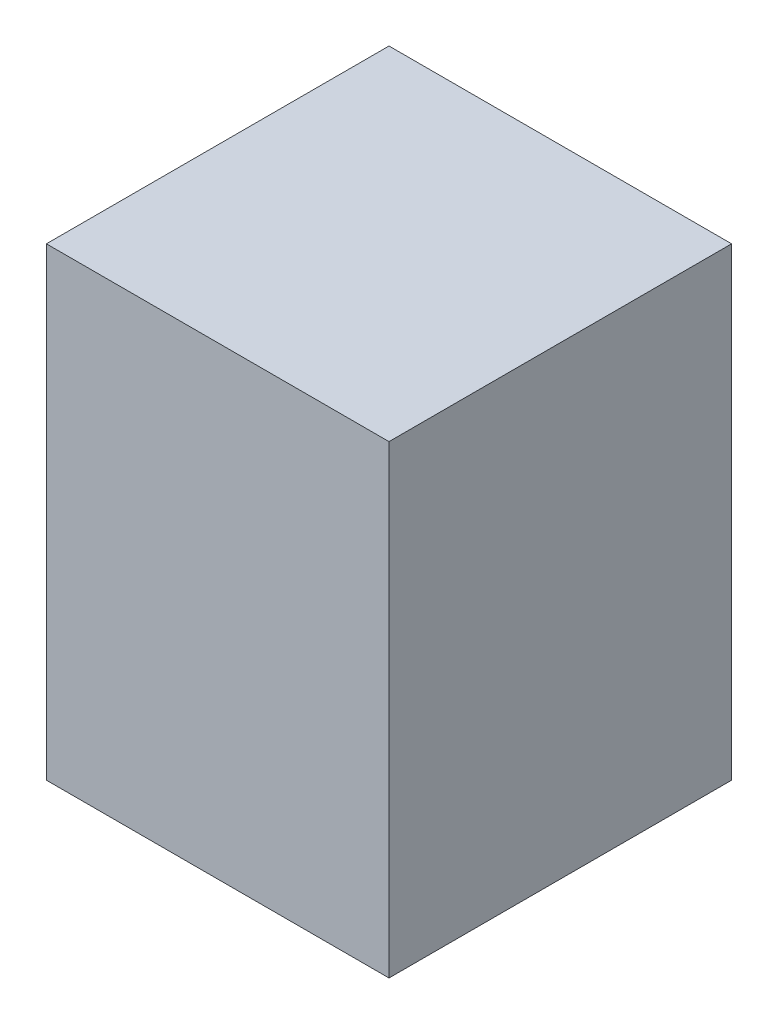
ISO-10303-21;
HEADER;
FILE_DESCRIPTION(('STEP AP214'),'2;1');
FILE_NAME('part.step','',(''),(''),'','','');
FILE_SCHEMA(('AUTOMOTIVE_DESIGN { 1 0 10303 214 1 1 1 1 }'));
ENDSEC;
DATA;
#1=APPLICATION_CONTEXT('core data for automotive mechanical design processes');
#2=APPLICATION_PROTOCOL_DEFINITION('international standard','automotive_design',2000,#1);
#3=PRODUCT_CONTEXT('',#1,'mechanical');
#4=PRODUCT('Part','Part','',(#3));
#5=PRODUCT_RELATED_PRODUCT_CATEGORY('part','',(#4));
#6=PRODUCT_DEFINITION_FORMATION('','',#4);
#7=PRODUCT_DEFINITION_CONTEXT('part definition',#1,'design');
#8=PRODUCT_DEFINITION('design','',#6,#7);
#9=PRODUCT_DEFINITION_SHAPE('','',#8);
#10=(LENGTH_UNIT() NAMED_UNIT(*) SI_UNIT(.MILLI.,.METRE.));
#11=(NAMED_UNIT(*) PLANE_ANGLE_UNIT() SI_UNIT($,.RADIAN.));
#12=(NAMED_UNIT(*) SI_UNIT($,.STERADIAN.) SOLID_ANGLE_UNIT());
#13=UNCERTAINTY_MEASURE_WITH_UNIT(LENGTH_MEASURE(1.E-05),#10,'distance_accuracy_value','');
#14=(GEOMETRIC_REPRESENTATION_CONTEXT(3) GLOBAL_UNCERTAINTY_ASSIGNED_CONTEXT((#13)) GLOBAL_UNIT_ASSIGNED_CONTEXT((#10,
#11,#12)) REPRESENTATION_CONTEXT('',''));
#15=CARTESIAN_POINT('',(0.,0.,0.));
#16=DIRECTION('',(0.,0.,1.));
#17=DIRECTION('',(1.,0.,0.));
#18=AXIS2_PLACEMENT_3D('',#15,#16,#17);
#19=CARTESIAN_POINT('',(-7.375,20.,7.375));
#20=DIRECTION('',(1.,0.,0.));
#21=DIRECTION('',(0.,0.,-1.));
#22=AXIS2_PLACEMENT_3D('',#19,#20,#21);
#23=PLANE('',#22);
#24=DIRECTION('',(0.,0.,1.));
#25=VECTOR('',#24,1.);
#26=CARTESIAN_POINT('',(-7.375,0.,7.375));
#27=LINE('',#26,#25);
#28=CARTESIAN_POINT('',(-7.375,0.,-7.375));
#29=VERTEX_POINT('',#28);
#30=CARTESIAN_POINT('',(-7.375,0.,7.375));
#31=VERTEX_POINT('',#30);
#32=EDGE_CURVE('E96',#29,#31,#27,.T.);
#33=ORIENTED_EDGE('',*,*,#32,.T.);
#34=DIRECTION('',(0.,-1.,0.));
#35=VECTOR('',#34,1.);
#36=CARTESIAN_POINT('',(-7.375,20.,7.375));
#37=LINE('',#36,#35);
#38=CARTESIAN_POINT('',(-7.375,20.,7.375));
#39=VERTEX_POINT('',#38);
#40=EDGE_CURVE('E11',#39,#31,#37,.T.);
#41=ORIENTED_EDGE('',*,*,#40,.F.);
#42=DIRECTION('',(0.,0.,1.));
#43=VECTOR('',#42,1.);
#44=CARTESIAN_POINT('',(-7.375,20.,7.375));
#45=LINE('',#44,#43);
#46=CARTESIAN_POINT('',(-7.375,20.,-7.375));
#47=VERTEX_POINT('',#46);
#48=EDGE_CURVE('E84',#47,#39,#45,.T.);
#49=ORIENTED_EDGE('',*,*,#48,.F.);
#50=DIRECTION('',(0.,-1.,0.));
#51=VECTOR('',#50,1.);
#52=CARTESIAN_POINT('',(-7.375,20.,-7.375));
#53=LINE('',#52,#51);
#54=EDGE_CURVE('E92',#47,#29,#53,.T.);
#55=ORIENTED_EDGE('',*,*,#54,.T.);
#56=EDGE_LOOP('',(#33,#41,#49,#55));
#57=FACE_BOUND('',#56,.T.);
#58=ADVANCED_FACE('F33',(#57),#23,.F.);
#59=CARTESIAN_POINT('',(7.375,20.,7.375));
#60=DIRECTION('',(0.,0.,-1.));
#61=DIRECTION('',(-1.,0.,0.));
#62=AXIS2_PLACEMENT_3D('',#59,#60,#61);
#63=PLANE('',#62);
#64=DIRECTION('',(1.,0.,0.));
#65=VECTOR('',#64,1.);
#66=CARTESIAN_POINT('',(7.375,0.,7.375));
#67=LINE('',#66,#65);
#68=CARTESIAN_POINT('',(7.375,0.,7.375));
#69=VERTEX_POINT('',#68);
#70=EDGE_CURVE('E88',#31,#69,#67,.T.);
#71=ORIENTED_EDGE('',*,*,#70,.T.);
#72=DIRECTION('',(0.,-1.,0.));
#73=VECTOR('',#72,1.);
#74=CARTESIAN_POINT('',(7.375,20.,7.375));
#75=LINE('',#74,#73);
#76=CARTESIAN_POINT('',(7.375,20.,7.375));
#77=VERTEX_POINT('',#76);
#78=EDGE_CURVE('E41',#77,#69,#75,.T.);
#79=ORIENTED_EDGE('',*,*,#78,.F.);
#80=DIRECTION('',(1.,0.,0.));
#81=VECTOR('',#80,1.);
#82=CARTESIAN_POINT('',(7.375,20.,7.375));
#83=LINE('',#82,#81);
#84=EDGE_CURVE('E79',#39,#77,#83,.T.);
#85=ORIENTED_EDGE('',*,*,#84,.F.);
#86=ORIENTED_EDGE('',*,*,#40,.T.);
#87=EDGE_LOOP('',(#71,#79,#85,#86));
#88=FACE_BOUND('',#87,.T.);
#89=ADVANCED_FACE('F87',(#88),#63,.F.);
#90=CARTESIAN_POINT('',(7.375,20.,7.375));
#91=DIRECTION('',(-1.,0.,0.));
#92=DIRECTION('',(0.,0.,1.));
#93=AXIS2_PLACEMENT_3D('',#90,#91,#92);
#94=PLANE('',#93);
#95=DIRECTION('',(0.,0.,-1.));
#96=VECTOR('',#95,1.);
#97=CARTESIAN_POINT('',(7.375,0.,7.375));
#98=LINE('',#97,#96);
#99=CARTESIAN_POINT('',(7.375,0.,-7.375));
#100=VERTEX_POINT('',#99);
#101=EDGE_CURVE('E66',#69,#100,#98,.T.);
#102=ORIENTED_EDGE('',*,*,#101,.T.);
#103=DIRECTION('',(0.,-1.,0.));
#104=VECTOR('',#103,1.);
#105=CARTESIAN_POINT('',(7.375,20.,-7.375));
#106=LINE('',#105,#104);
#107=CARTESIAN_POINT('',(7.375,20.,-7.375));
#108=VERTEX_POINT('',#107);
#109=EDGE_CURVE('E89',#108,#100,#106,.T.);
#110=ORIENTED_EDGE('',*,*,#109,.F.);
#111=DIRECTION('',(0.,0.,-1.));
#112=VECTOR('',#111,1.);
#113=CARTESIAN_POINT('',(7.375,20.,7.375));
#114=LINE('',#113,#112);
#115=EDGE_CURVE('E82',#77,#108,#114,.T.);
#116=ORIENTED_EDGE('',*,*,#115,.F.);
#117=ORIENTED_EDGE('',*,*,#78,.T.);
#118=EDGE_LOOP('',(#102,#110,#116,#117));
#119=FACE_BOUND('',#118,.T.);
#120=ADVANCED_FACE('F90',(#119),#94,.F.);
#121=CARTESIAN_POINT('',(7.375,20.,-7.375));
#122=DIRECTION('',(0.,0.,1.));
#123=DIRECTION('',(1.,0.,0.));
#124=AXIS2_PLACEMENT_3D('',#121,#122,#123);
#125=PLANE('',#124);
#126=DIRECTION('',(-1.,0.,0.));
#127=VECTOR('',#126,1.);
#128=CARTESIAN_POINT('',(7.375,0.,-7.375));
#129=LINE('',#128,#127);
#130=EDGE_CURVE('E72',#100,#29,#129,.T.);
#131=ORIENTED_EDGE('',*,*,#130,.T.);
#132=ORIENTED_EDGE('',*,*,#54,.F.);
#133=DIRECTION('',(-1.,0.,0.));
#134=VECTOR('',#133,1.);
#135=CARTESIAN_POINT('',(7.375,20.,-7.375));
#136=LINE('',#135,#134);
#137=EDGE_CURVE('E49',#108,#47,#136,.T.);
#138=ORIENTED_EDGE('',*,*,#137,.F.);
#139=ORIENTED_EDGE('',*,*,#109,.T.);
#140=EDGE_LOOP('',(#131,#132,#138,#139));
#141=FACE_BOUND('',#140,.T.);
#142=ADVANCED_FACE('F103',(#141),#125,.F.);
#143=CARTESIAN_POINT('',(0.,20.,0.));
#144=DIRECTION('',(0.,1.,0.));
#145=DIRECTION('',(0.,0.,1.));
#146=AXIS2_PLACEMENT_3D('',#143,#144,#145);
#147=PLANE('',#146);
#148=ORIENTED_EDGE('',*,*,#48,.T.);
#149=ORIENTED_EDGE('',*,*,#84,.T.);
#150=ORIENTED_EDGE('',*,*,#115,.T.);
#151=ORIENTED_EDGE('',*,*,#137,.T.);
#152=EDGE_LOOP('',(#148,#149,#150,#151));
#153=FACE_BOUND('',#152,.T.);
#154=ADVANCED_FACE('F80',(#153),#147,.T.);
#155=CARTESIAN_POINT('',(0.,0.,0.));
#156=DIRECTION('',(0.,1.,0.));
#157=DIRECTION('',(0.,0.,1.));
#158=AXIS2_PLACEMENT_3D('',#155,#156,#157);
#159=PLANE('',#158);
#160=ORIENTED_EDGE('',*,*,#32,.F.);
#161=ORIENTED_EDGE('',*,*,#130,.F.);
#162=ORIENTED_EDGE('',*,*,#101,.F.);
#163=ORIENTED_EDGE('',*,*,#70,.F.);
#164=EDGE_LOOP('',(#160,#161,#162,#163));
#165=FACE_BOUND('',#164,.T.);
#166=ADVANCED_FACE('F106',(#165),#159,.F.);
#167=CLOSED_SHELL('',(#58,#89,#120,#142,#154,#166));
#168=MANIFOLD_SOLID_BREP('B2',#167);
#169=ADVANCED_BREP_SHAPE_REPRESENTATION('',(#18,#168),#14);
#170=SHAPE_DEFINITION_REPRESENTATION(#9,#169);
ENDSEC;
END-ISO-10303-21;
